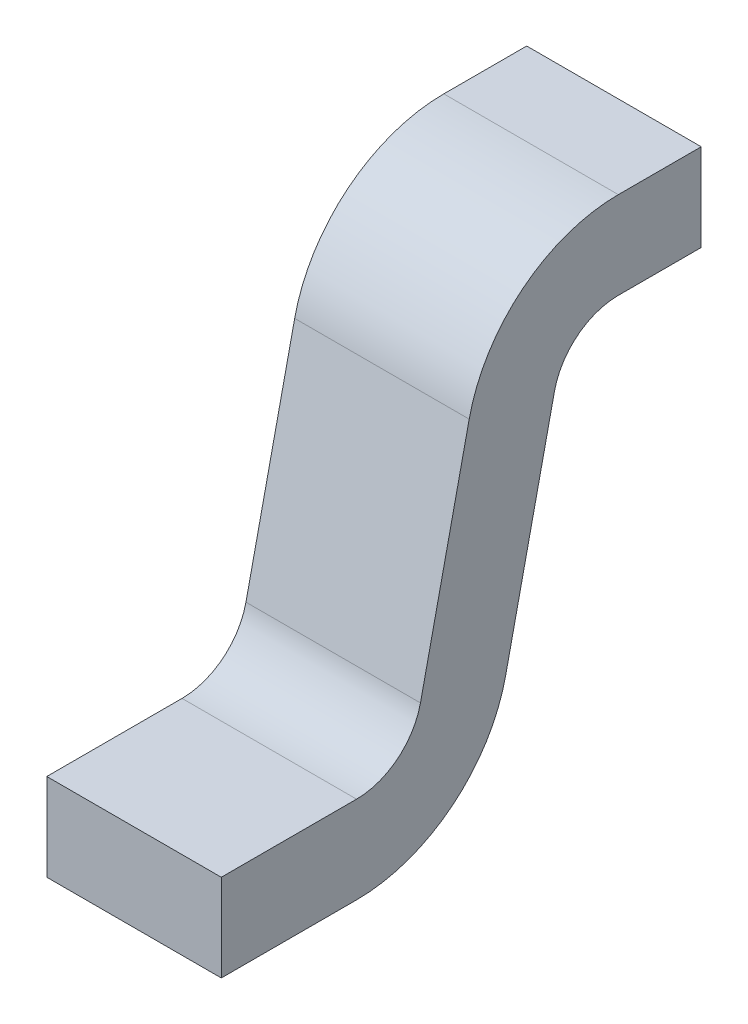
ISO-10303-21;
HEADER;
FILE_DESCRIPTION(('STEP AP214'),'2;1');
FILE_NAME('part.step','',(''),(''),'','','');
FILE_SCHEMA(('AUTOMOTIVE_DESIGN { 1 0 10303 214 1 1 1 1 }'));
ENDSEC;
DATA;
#1=APPLICATION_CONTEXT('core data for automotive mechanical design processes');
#2=APPLICATION_PROTOCOL_DEFINITION('international standard','automotive_design',2000,#1);
#3=PRODUCT_CONTEXT('',#1,'mechanical');
#4=PRODUCT('Part','Part','',(#3));
#5=PRODUCT_RELATED_PRODUCT_CATEGORY('part','',(#4));
#6=PRODUCT_DEFINITION_FORMATION('','',#4);
#7=PRODUCT_DEFINITION_CONTEXT('part definition',#1,'design');
#8=PRODUCT_DEFINITION('design','',#6,#7);
#9=PRODUCT_DEFINITION_SHAPE('','',#8);
#10=(LENGTH_UNIT() NAMED_UNIT(*) SI_UNIT(.MILLI.,.METRE.));
#11=(NAMED_UNIT(*) PLANE_ANGLE_UNIT() SI_UNIT($,.RADIAN.));
#12=(NAMED_UNIT(*) SI_UNIT($,.STERADIAN.) SOLID_ANGLE_UNIT());
#13=UNCERTAINTY_MEASURE_WITH_UNIT(LENGTH_MEASURE(1.E-05),#10,'distance_accuracy_value','');
#14=(GEOMETRIC_REPRESENTATION_CONTEXT(3) GLOBAL_UNCERTAINTY_ASSIGNED_CONTEXT((#13)) GLOBAL_UNIT_ASSIGNED_CONTEXT((#10,
#11,#12)) REPRESENTATION_CONTEXT('',''));
#15=CARTESIAN_POINT('',(0.,0.,0.));
#16=DIRECTION('',(0.,0.,1.));
#17=DIRECTION('',(1.,0.,0.));
#18=AXIS2_PLACEMENT_3D('',#15,#16,#17);
#19=CARTESIAN_POINT('',(-0.2,-0.25,0.19));
#20=DIRECTION('',(1.,0.,0.));
#21=DIRECTION('',(0.,0.,-1.));
#22=AXIS2_PLACEMENT_3D('',#19,#20,#21);
#23=PLANE('',#22);
#24=DIRECTION('',(0.,0.976627109439069,-0.214940664158015));
#25=VECTOR('',#24,1.);
#26=CARTESIAN_POINT('',(-0.2,-0.217758900376,0.336494066416));
#27=LINE('',#26,#25);
#28=CARTESIAN_POINT('',(-0.2,-0.725229232455129,0.448180511696269));
#29=VERTEX_POINT('',#28);
#30=CARTESIAN_POINT('',(-0.2,-0.217758900376149,0.33649406641593));
#31=VERTEX_POINT('',#30);
#32=EDGE_CURVE('E96',#29,#31,#27,.T.);
#33=ORIENTED_EDGE('',*,*,#32,.F.);
#34=CARTESIAN_POINT('',(-0.2,-0.65,0.79));
#35=DIRECTION('',(1.,0.,0.));
#36=DIRECTION('',(0.,0.,-1.));
#37=AXIS2_PLACEMENT_3D('',#34,#35,#36);
#38=CIRCLE('',#37,0.35);
#39=CARTESIAN_POINT('',(-0.2,-1.,0.79));
#40=VERTEX_POINT('',#39);
#41=EDGE_CURVE('E165',#40,#29,#38,.T.);
#42=ORIENTED_EDGE('',*,*,#41,.F.);
#43=DIRECTION('',(0.,0.,-1.));
#44=VECTOR('',#43,1.);
#45=CARTESIAN_POINT('',(-0.2,-1.,1.1));
#46=LINE('',#45,#44);
#47=CARTESIAN_POINT('',(-0.2,-1.,1.1));
#48=VERTEX_POINT('',#47);
#49=EDGE_CURVE('E118',#48,#40,#46,.T.);
#50=ORIENTED_EDGE('',*,*,#49,.F.);
#51=DIRECTION('',(0.,1.,0.));
#52=VECTOR('',#51,1.);
#53=CARTESIAN_POINT('',(-0.2,-1.,1.1));
#54=LINE('',#53,#52);
#55=CARTESIAN_POINT('',(-0.2,-0.8,1.1));
#56=VERTEX_POINT('',#55);
#57=EDGE_CURVE('E123',#48,#56,#54,.T.);
#58=ORIENTED_EDGE('',*,*,#57,.T.);
#59=DIRECTION('',(0.,0.,-1.));
#60=VECTOR('',#59,1.);
#61=CARTESIAN_POINT('',(-0.2,-0.8,1.1));
#62=LINE('',#61,#60);
#63=CARTESIAN_POINT('',(-0.2,-0.8,0.79));
#64=VERTEX_POINT('',#63);
#65=EDGE_CURVE('E130',#56,#64,#62,.T.);
#66=ORIENTED_EDGE('',*,*,#65,.T.);
#67=CARTESIAN_POINT('',(-0.2,-0.65,0.79));
#68=DIRECTION('',(1.,0.,0.));
#69=DIRECTION('',(0.,0.,-1.));
#70=AXIS2_PLACEMENT_3D('',#67,#68,#69);
#71=CIRCLE('',#70,0.15);
#72=CARTESIAN_POINT('',(-0.2,-0.682241099623828,0.643505933584176));
#73=VERTEX_POINT('',#72);
#74=EDGE_CURVE('E167',#64,#73,#71,.T.);
#75=ORIENTED_EDGE('',*,*,#74,.T.);
#76=DIRECTION('',(0.,0.976627109439069,-0.214940664158015));
#77=VECTOR('',#76,1.);
#78=CARTESIAN_POINT('',(-0.2,-0.174770767545,0.531819488304));
#79=LINE('',#78,#77);
#80=CARTESIAN_POINT('',(-0.2,-0.17477076754482,0.531819488303961));
#81=VERTEX_POINT('',#80);
#82=EDGE_CURVE('E135',#73,#81,#79,.T.);
#83=ORIENTED_EDGE('',*,*,#82,.T.);
#84=CARTESIAN_POINT('',(-0.2,-0.25,0.19));
#85=DIRECTION('',(1.,0.,0.));
#86=DIRECTION('',(0.,0.,-1.));
#87=AXIS2_PLACEMENT_3D('',#84,#85,#86);
#88=CIRCLE('',#87,0.35);
#89=CARTESIAN_POINT('',(-0.2,0.1,0.19));
#90=VERTEX_POINT('',#89);
#91=EDGE_CURVE('E138',#90,#81,#88,.T.);
#92=ORIENTED_EDGE('',*,*,#91,.F.);
#93=DIRECTION('',(0.,0.,-1.));
#94=VECTOR('',#93,1.);
#95=CARTESIAN_POINT('',(-0.2,0.1,0.19));
#96=LINE('',#95,#94);
#97=CARTESIAN_POINT('',(-0.2,0.1,0.));
#98=VERTEX_POINT('',#97);
#99=EDGE_CURVE('E139',#90,#98,#96,.T.);
#100=ORIENTED_EDGE('',*,*,#99,.T.);
#101=DIRECTION('',(0.,1.,0.));
#102=VECTOR('',#101,1.);
#103=CARTESIAN_POINT('',(-0.2,0.1,0.));
#104=LINE('',#103,#102);
#105=CARTESIAN_POINT('',(-0.2,-0.1,0.));
#106=VERTEX_POINT('',#105);
#107=EDGE_CURVE('E146',#98,#106,#104,.F.);
#108=ORIENTED_EDGE('',*,*,#107,.T.);
#109=DIRECTION('',(0.,0.,-1.));
#110=VECTOR('',#109,1.);
#111=CARTESIAN_POINT('',(-0.2,-0.1,0.19));
#112=LINE('',#111,#110);
#113=CARTESIAN_POINT('',(-0.2,-0.1,0.19));
#114=VERTEX_POINT('',#113);
#115=EDGE_CURVE('E99',#114,#106,#112,.T.);
#116=ORIENTED_EDGE('',*,*,#115,.F.);
#117=CARTESIAN_POINT('',(-0.2,-0.25,0.19));
#118=DIRECTION('',(1.,0.,0.));
#119=DIRECTION('',(0.,0.,-1.));
#120=AXIS2_PLACEMENT_3D('',#117,#118,#119);
#121=CIRCLE('',#120,0.15);
#122=EDGE_CURVE('E20',#114,#31,#121,.T.);
#123=ORIENTED_EDGE('',*,*,#122,.T.);
#124=EDGE_LOOP('',(#33,#42,#50,#58,#66,#75,#83,#92,#100,#108,#116,#123));
#125=FACE_BOUND('',#124,.T.);
#126=ADVANCED_FACE('F17',(#125),#23,.F.);
#127=CARTESIAN_POINT('',(-0.2,-0.217758900376,0.336494066416));
#128=DIRECTION('',(0.,-0.214940664158015,-0.976627109439069));
#129=DIRECTION('',(0.,0.976627109439069,-0.214940664158015));
#130=AXIS2_PLACEMENT_3D('',#127,#128,#129);
#131=PLANE('',#130);
#132=DIRECTION('',(1.,0.,0.));
#133=VECTOR('',#132,1.);
#134=CARTESIAN_POINT('',(-0.2,-0.217758900376043,0.336494066415804));
#135=LINE('',#134,#133);
#136=CARTESIAN_POINT('',(0.2,-0.21775890037618,0.336494066415937));
#137=VERTEX_POINT('',#136);
#138=EDGE_CURVE('E101',#31,#137,#135,.T.);
#139=ORIENTED_EDGE('',*,*,#138,.T.);
#140=DIRECTION('',(0.,0.976627109439159,-0.214940664157606));
#141=VECTOR('',#140,1.);
#142=CARTESIAN_POINT('',(0.2,-0.725229232455,0.448180511696));
#143=LINE('',#142,#141);
#144=CARTESIAN_POINT('',(0.2,-0.725229232455081,0.448180511696147));
#145=VERTEX_POINT('',#144);
#146=EDGE_CURVE('E164',#145,#137,#143,.T.);
#147=ORIENTED_EDGE('',*,*,#146,.F.);
#148=DIRECTION('',(1.,0.,0.));
#149=VECTOR('',#148,1.);
#150=CARTESIAN_POINT('',(-0.2,-0.725229232454946,0.448180511696247));
#151=LINE('',#150,#149);
#152=EDGE_CURVE('E106',#29,#145,#151,.T.);
#153=ORIENTED_EDGE('',*,*,#152,.F.);
#154=ORIENTED_EDGE('',*,*,#32,.T.);
#155=EDGE_LOOP('',(#139,#147,#153,#154));
#156=FACE_BOUND('',#155,.T.);
#157=ADVANCED_FACE('F103',(#156),#131,.T.);
#158=CARTESIAN_POINT('',(-0.2,-0.25,0.19));
#159=DIRECTION('',(1.,0.,0.));
#160=DIRECTION('',(0.,0.,-1.));
#161=AXIS2_PLACEMENT_3D('',#158,#159,#160);
#162=CYLINDRICAL_SURFACE('',#161,0.15);
#163=ORIENTED_EDGE('',*,*,#138,.F.);
#164=ORIENTED_EDGE('',*,*,#122,.F.);
#165=DIRECTION('',(1.,0.,0.));
#166=VECTOR('',#165,1.);
#167=CARTESIAN_POINT('',(-0.2,-0.1,0.19));
#168=LINE('',#167,#166);
#169=CARTESIAN_POINT('',(0.2,-0.1,0.19));
#170=VERTEX_POINT('',#169);
#171=EDGE_CURVE('E113',#170,#114,#168,.F.);
#172=ORIENTED_EDGE('',*,*,#171,.F.);
#173=CARTESIAN_POINT('',(0.2,-0.25,0.19));
#174=DIRECTION('',(1.,0.,0.));
#175=DIRECTION('',(0.,0.,-1.));
#176=AXIS2_PLACEMENT_3D('',#173,#174,#175);
#177=CIRCLE('',#176,0.15);
#178=EDGE_CURVE('E111',#137,#170,#177,.F.);
#179=ORIENTED_EDGE('',*,*,#178,.F.);
#180=EDGE_LOOP('',(#163,#164,#172,#179));
#181=FACE_BOUND('',#180,.T.);
#182=ADVANCED_FACE('F109',(#181),#162,.F.);
#183=CARTESIAN_POINT('',(-0.2,-0.1,0.19));
#184=DIRECTION('',(0.,-1.,0.));
#185=DIRECTION('',(0.,0.,-1.));
#186=AXIS2_PLACEMENT_3D('',#183,#184,#185);
#187=PLANE('',#186);
#188=DIRECTION('',(1.,0.,0.));
#189=VECTOR('',#188,1.);
#190=CARTESIAN_POINT('',(-0.2,-0.1,0.));
#191=LINE('',#190,#189);
#192=CARTESIAN_POINT('',(0.2,-0.1,0.));
#193=VERTEX_POINT('',#192);
#194=EDGE_CURVE('E143',#106,#193,#191,.T.);
#195=ORIENTED_EDGE('',*,*,#194,.T.);
#196=DIRECTION('',(0.,0.,-1.));
#197=VECTOR('',#196,1.);
#198=CARTESIAN_POINT('',(0.2,-0.1,0.19));
#199=LINE('',#198,#197);
#200=EDGE_CURVE('E163',#170,#193,#199,.T.);
#201=ORIENTED_EDGE('',*,*,#200,.F.);
#202=ORIENTED_EDGE('',*,*,#171,.T.);
#203=ORIENTED_EDGE('',*,*,#115,.T.);
#204=EDGE_LOOP('',(#195,#201,#202,#203));
#205=FACE_BOUND('',#204,.T.);
#206=ADVANCED_FACE('F194',(#205),#187,.T.);
#207=CARTESIAN_POINT('',(-0.2,0.1,0.));
#208=DIRECTION('',(0.,0.,1.));
#209=DIRECTION('',(1.,0.,0.));
#210=AXIS2_PLACEMENT_3D('',#207,#208,#209);
#211=PLANE('',#210);
#212=ORIENTED_EDGE('',*,*,#194,.F.);
#213=ORIENTED_EDGE('',*,*,#107,.F.);
#214=DIRECTION('',(1.,0.,0.));
#215=VECTOR('',#214,1.);
#216=CARTESIAN_POINT('',(-0.2,0.1,0.));
#217=LINE('',#216,#215);
#218=CARTESIAN_POINT('',(0.2,0.1,0.));
#219=VERTEX_POINT('',#218);
#220=EDGE_CURVE('E142',#98,#219,#217,.T.);
#221=ORIENTED_EDGE('',*,*,#220,.T.);
#222=DIRECTION('',(0.,1.,0.));
#223=VECTOR('',#222,1.);
#224=CARTESIAN_POINT('',(0.2,-0.25,0.));
#225=LINE('',#224,#223);
#226=EDGE_CURVE('E183',#193,#219,#225,.T.);
#227=ORIENTED_EDGE('',*,*,#226,.F.);
#228=EDGE_LOOP('',(#212,#213,#221,#227));
#229=FACE_BOUND('',#228,.T.);
#230=ADVANCED_FACE('F199',(#229),#211,.F.);
#231=CARTESIAN_POINT('',(-0.2,0.1,0.19));
#232=DIRECTION('',(0.,-1.,0.));
#233=DIRECTION('',(0.,0.,-1.));
#234=AXIS2_PLACEMENT_3D('',#231,#232,#233);
#235=PLANE('',#234);
#236=ORIENTED_EDGE('',*,*,#220,.F.);
#237=ORIENTED_EDGE('',*,*,#99,.F.);
#238=DIRECTION('',(1.,0.,0.));
#239=VECTOR('',#238,1.);
#240=CARTESIAN_POINT('',(-0.2,0.1,0.19));
#241=LINE('',#240,#239);
#242=CARTESIAN_POINT('',(0.2,0.1,0.19));
#243=VERTEX_POINT('',#242);
#244=EDGE_CURVE('E169',#243,#90,#241,.F.);
#245=ORIENTED_EDGE('',*,*,#244,.F.);
#246=DIRECTION('',(0.,0.,-1.));
#247=VECTOR('',#246,1.);
#248=CARTESIAN_POINT('',(0.2,0.1,0.19));
#249=LINE('',#248,#247);
#250=EDGE_CURVE('E161',#219,#243,#249,.F.);
#251=ORIENTED_EDGE('',*,*,#250,.F.);
#252=EDGE_LOOP('',(#236,#237,#245,#251));
#253=FACE_BOUND('',#252,.T.);
#254=ADVANCED_FACE('F247',(#253),#235,.F.);
#255=CARTESIAN_POINT('',(-0.2,-0.25,0.19));
#256=DIRECTION('',(1.,0.,0.));
#257=DIRECTION('',(0.,0.,-1.));
#258=AXIS2_PLACEMENT_3D('',#255,#256,#257);
#259=CYLINDRICAL_SURFACE('',#258,0.35);
#260=DIRECTION('',(1.,0.,0.));
#261=VECTOR('',#260,1.);
#262=CARTESIAN_POINT('',(-0.2,-0.174770767545,0.531819488304));
#263=LINE('',#262,#261);
#264=CARTESIAN_POINT('',(0.2,-0.174770767544892,0.531819488303976));
#265=VERTEX_POINT('',#264);
#266=EDGE_CURVE('E137',#81,#265,#263,.T.);
#267=ORIENTED_EDGE('',*,*,#266,.T.);
#268=CARTESIAN_POINT('',(0.2,-0.25,0.19));
#269=DIRECTION('',(1.,0.,0.));
#270=DIRECTION('',(0.,0.,-1.));
#271=AXIS2_PLACEMENT_3D('',#268,#269,#270);
#272=CIRCLE('',#271,0.35);
#273=EDGE_CURVE('E158',#243,#265,#272,.T.);
#274=ORIENTED_EDGE('',*,*,#273,.F.);
#275=ORIENTED_EDGE('',*,*,#244,.T.);
#276=ORIENTED_EDGE('',*,*,#91,.T.);
#277=EDGE_LOOP('',(#267,#274,#275,#276));
#278=FACE_BOUND('',#277,.T.);
#279=ADVANCED_FACE('F284',(#278),#259,.T.);
#280=CARTESIAN_POINT('',(-0.2,-0.174770767545,0.531819488304));
#281=DIRECTION('',(0.,-0.214940664158015,-0.976627109439069));
#282=DIRECTION('',(0.,0.976627109439069,-0.214940664158015));
#283=AXIS2_PLACEMENT_3D('',#280,#281,#282);
#284=PLANE('',#283);
#285=ORIENTED_EDGE('',*,*,#266,.F.);
#286=ORIENTED_EDGE('',*,*,#82,.F.);
#287=DIRECTION('',(1.,0.,0.));
#288=VECTOR('',#287,1.);
#289=CARTESIAN_POINT('',(-0.2,-0.682241099623957,0.643505933584196));
#290=LINE('',#289,#288);
#291=CARTESIAN_POINT('',(0.2,-0.682241099623821,0.643505933584063));
#292=VERTEX_POINT('',#291);
#293=EDGE_CURVE('E132',#73,#292,#290,.T.);
#294=ORIENTED_EDGE('',*,*,#293,.T.);
#295=DIRECTION('',(0.,-0.976627109439159,0.214940664157606));
#296=VECTOR('',#295,1.);
#297=CARTESIAN_POINT('',(0.2,-0.174770767545,0.531819488304));
#298=LINE('',#297,#296);
#299=EDGE_CURVE('E157',#265,#292,#298,.T.);
#300=ORIENTED_EDGE('',*,*,#299,.F.);
#301=EDGE_LOOP('',(#285,#286,#294,#300));
#302=FACE_BOUND('',#301,.T.);
#303=ADVANCED_FACE('F234',(#302),#284,.F.);
#304=CARTESIAN_POINT('',(-0.2,-0.65,0.79));
#305=DIRECTION('',(1.,0.,0.));
#306=DIRECTION('',(0.,0.,-1.));
#307=AXIS2_PLACEMENT_3D('',#304,#305,#306);
#308=CYLINDRICAL_SURFACE('',#307,0.15);
#309=ORIENTED_EDGE('',*,*,#293,.F.);
#310=ORIENTED_EDGE('',*,*,#74,.F.);
#311=DIRECTION('',(1.,0.,0.));
#312=VECTOR('',#311,1.);
#313=CARTESIAN_POINT('',(-0.2,-0.8,0.79));
#314=LINE('',#313,#312);
#315=CARTESIAN_POINT('',(0.2,-0.8,0.79));
#316=VERTEX_POINT('',#315);
#317=EDGE_CURVE('E127',#64,#316,#314,.T.);
#318=ORIENTED_EDGE('',*,*,#317,.T.);
#319=CARTESIAN_POINT('',(0.2,-0.65,0.79));
#320=DIRECTION('',(1.,0.,0.));
#321=DIRECTION('',(0.,0.,-1.));
#322=AXIS2_PLACEMENT_3D('',#319,#320,#321);
#323=CIRCLE('',#322,0.15);
#324=EDGE_CURVE('E153',#292,#316,#323,.F.);
#325=ORIENTED_EDGE('',*,*,#324,.F.);
#326=EDGE_LOOP('',(#309,#310,#318,#325));
#327=FACE_BOUND('',#326,.T.);
#328=ADVANCED_FACE('F238',(#327),#308,.F.);
#329=CARTESIAN_POINT('',(-0.2,-0.8,1.1));
#330=DIRECTION('',(0.,-1.,0.));
#331=DIRECTION('',(0.,0.,-1.));
#332=AXIS2_PLACEMENT_3D('',#329,#330,#331);
#333=PLANE('',#332);
#334=ORIENTED_EDGE('',*,*,#317,.F.);
#335=ORIENTED_EDGE('',*,*,#65,.F.);
#336=DIRECTION('',(-1.,0.,0.));
#337=VECTOR('',#336,1.);
#338=CARTESIAN_POINT('',(-0.2,-0.8,1.1));
#339=LINE('',#338,#337);
#340=CARTESIAN_POINT('',(0.2,-0.8,1.1));
#341=VERTEX_POINT('',#340);
#342=EDGE_CURVE('E126',#56,#341,#339,.F.);
#343=ORIENTED_EDGE('',*,*,#342,.T.);
#344=DIRECTION('',(0.,0.,-1.));
#345=VECTOR('',#344,1.);
#346=CARTESIAN_POINT('',(0.2,-0.8,0.19));
#347=LINE('',#346,#345);
#348=EDGE_CURVE('E156',#316,#341,#347,.F.);
#349=ORIENTED_EDGE('',*,*,#348,.F.);
#350=EDGE_LOOP('',(#334,#335,#343,#349));
#351=FACE_BOUND('',#350,.T.);
#352=ADVANCED_FACE('F253',(#351),#333,.F.);
#353=CARTESIAN_POINT('',(-0.2,-1.,1.1));
#354=DIRECTION('',(0.,0.,-1.));
#355=DIRECTION('',(-1.,0.,0.));
#356=AXIS2_PLACEMENT_3D('',#353,#354,#355);
#357=PLANE('',#356);
#358=ORIENTED_EDGE('',*,*,#342,.F.);
#359=ORIENTED_EDGE('',*,*,#57,.F.);
#360=DIRECTION('',(1.,0.,0.));
#361=VECTOR('',#360,1.);
#362=CARTESIAN_POINT('',(-0.2,-1.,1.1));
#363=LINE('',#362,#361);
#364=CARTESIAN_POINT('',(0.2,-1.,1.1));
#365=VERTEX_POINT('',#364);
#366=EDGE_CURVE('E120',#365,#48,#363,.F.);
#367=ORIENTED_EDGE('',*,*,#366,.F.);
#368=DIRECTION('',(0.,1.,0.));
#369=VECTOR('',#368,1.);
#370=CARTESIAN_POINT('',(0.2,-0.25,1.1));
#371=LINE('',#370,#369);
#372=EDGE_CURVE('E220',#341,#365,#371,.F.);
#373=ORIENTED_EDGE('',*,*,#372,.F.);
#374=EDGE_LOOP('',(#358,#359,#367,#373));
#375=FACE_BOUND('',#374,.T.);
#376=ADVANCED_FACE('F263',(#375),#357,.F.);
#377=CARTESIAN_POINT('',(-0.2,-1.,1.1));
#378=DIRECTION('',(0.,-1.,0.));
#379=DIRECTION('',(0.,0.,-1.));
#380=AXIS2_PLACEMENT_3D('',#377,#378,#379);
#381=PLANE('',#380);
#382=DIRECTION('',(1.,0.,0.));
#383=VECTOR('',#382,1.);
#384=CARTESIAN_POINT('',(-0.2,-1.,0.79));
#385=LINE('',#384,#383);
#386=CARTESIAN_POINT('',(0.2,-1.,0.79));
#387=VERTEX_POINT('',#386);
#388=EDGE_CURVE('E35',#387,#40,#385,.F.);
#389=ORIENTED_EDGE('',*,*,#388,.F.);
#390=DIRECTION('',(0.,0.,-1.));
#391=VECTOR('',#390,1.);
#392=CARTESIAN_POINT('',(0.2,-1.,0.19));
#393=LINE('',#392,#391);
#394=EDGE_CURVE('E26',#365,#387,#393,.T.);
#395=ORIENTED_EDGE('',*,*,#394,.F.);
#396=ORIENTED_EDGE('',*,*,#366,.T.);
#397=ORIENTED_EDGE('',*,*,#49,.T.);
#398=EDGE_LOOP('',(#389,#395,#396,#397));
#399=FACE_BOUND('',#398,.T.);
#400=ADVANCED_FACE('F259',(#399),#381,.T.);
#401=CARTESIAN_POINT('',(-0.2,-0.65,0.79));
#402=DIRECTION('',(1.,0.,0.));
#403=DIRECTION('',(0.,0.,-1.));
#404=AXIS2_PLACEMENT_3D('',#401,#402,#403);
#405=CYLINDRICAL_SURFACE('',#404,0.35);
#406=ORIENTED_EDGE('',*,*,#152,.T.);
#407=CARTESIAN_POINT('',(0.2,-0.65,0.79));
#408=DIRECTION('',(1.,0.,0.));
#409=DIRECTION('',(0.,0.,-1.));
#410=AXIS2_PLACEMENT_3D('',#407,#408,#409);
#411=CIRCLE('',#410,0.35);
#412=EDGE_CURVE('E11',#387,#145,#411,.T.);
#413=ORIENTED_EDGE('',*,*,#412,.F.);
#414=ORIENTED_EDGE('',*,*,#388,.T.);
#415=ORIENTED_EDGE('',*,*,#41,.T.);
#416=EDGE_LOOP('',(#406,#413,#414,#415));
#417=FACE_BOUND('',#416,.T.);
#418=ADVANCED_FACE('F265',(#417),#405,.T.);
#419=CARTESIAN_POINT('',(0.2,-0.25,0.19));
#420=DIRECTION('',(1.,0.,0.));
#421=DIRECTION('',(0.,0.,-1.));
#422=AXIS2_PLACEMENT_3D('',#419,#420,#421);
#423=PLANE('',#422);
#424=ORIENTED_EDGE('',*,*,#394,.T.);
#425=ORIENTED_EDGE('',*,*,#412,.T.);
#426=ORIENTED_EDGE('',*,*,#146,.T.);
#427=ORIENTED_EDGE('',*,*,#178,.T.);
#428=ORIENTED_EDGE('',*,*,#200,.T.);
#429=ORIENTED_EDGE('',*,*,#226,.T.);
#430=ORIENTED_EDGE('',*,*,#250,.T.);
#431=ORIENTED_EDGE('',*,*,#273,.T.);
#432=ORIENTED_EDGE('',*,*,#299,.T.);
#433=ORIENTED_EDGE('',*,*,#324,.T.);
#434=ORIENTED_EDGE('',*,*,#348,.T.);
#435=ORIENTED_EDGE('',*,*,#372,.T.);
#436=EDGE_LOOP('',(#424,#425,#426,#427,#428,#429,#430,#431,#432,#433,#434,#435));
#437=FACE_BOUND('',#436,.T.);
#438=ADVANCED_FACE('F205',(#437),#423,.T.);
#439=CLOSED_SHELL('',(#126,#157,#182,#206,#230,#254,#279,#303,#328,#352,#376,#400,#418,#438));
#440=MANIFOLD_SOLID_BREP('B1',#439);
#441=ADVANCED_BREP_SHAPE_REPRESENTATION('',(#18,#440),#14);
#442=SHAPE_DEFINITION_REPRESENTATION(#9,#441);
ENDSEC;
END-ISO-10303-21;
